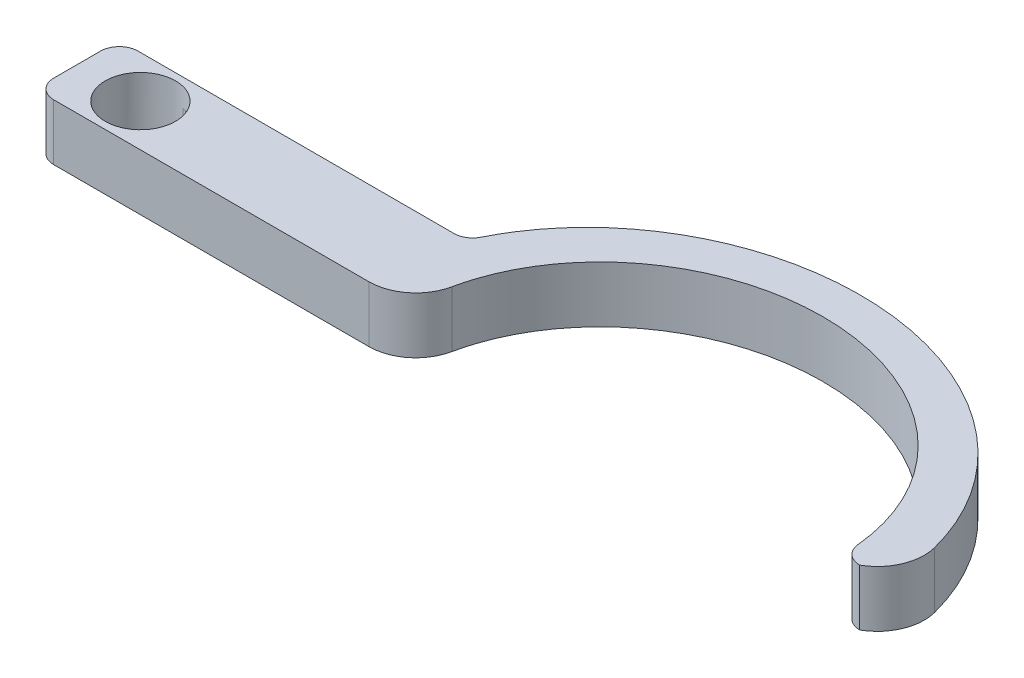
ISO-10303-21;
HEADER;
FILE_DESCRIPTION(('STEP AP214'),'2;1');
FILE_NAME('part.step','',(''),(''),'','','');
FILE_SCHEMA(('AUTOMOTIVE_DESIGN { 1 0 10303 214 1 1 1 1 }'));
ENDSEC;
DATA;
#1=APPLICATION_CONTEXT('core data for automotive mechanical design processes');
#2=APPLICATION_PROTOCOL_DEFINITION('international standard','automotive_design',2000,#1);
#3=PRODUCT_CONTEXT('',#1,'mechanical');
#4=PRODUCT('Part','Part','',(#3));
#5=PRODUCT_RELATED_PRODUCT_CATEGORY('part','',(#4));
#6=PRODUCT_DEFINITION_FORMATION('','',#4);
#7=PRODUCT_DEFINITION_CONTEXT('part definition',#1,'design');
#8=PRODUCT_DEFINITION('design','',#6,#7);
#9=PRODUCT_DEFINITION_SHAPE('','',#8);
#10=(LENGTH_UNIT() NAMED_UNIT(*) SI_UNIT(.MILLI.,.METRE.));
#11=(NAMED_UNIT(*) PLANE_ANGLE_UNIT() SI_UNIT($,.RADIAN.));
#12=(NAMED_UNIT(*) SI_UNIT($,.STERADIAN.) SOLID_ANGLE_UNIT());
#13=UNCERTAINTY_MEASURE_WITH_UNIT(LENGTH_MEASURE(1.E-05),#10,'distance_accuracy_value','');
#14=(GEOMETRIC_REPRESENTATION_CONTEXT(3) GLOBAL_UNCERTAINTY_ASSIGNED_CONTEXT((#13)) GLOBAL_UNIT_ASSIGNED_CONTEXT((#10,
#11,#12)) REPRESENTATION_CONTEXT('',''));
#15=CARTESIAN_POINT('',(0.,0.,0.));
#16=DIRECTION('',(0.,0.,1.));
#17=DIRECTION('',(1.,0.,0.));
#18=AXIS2_PLACEMENT_3D('',#15,#16,#17);
#19=CARTESIAN_POINT('',(17.,-6.,0.));
#20=DIRECTION('',(0.,1.,0.));
#21=DIRECTION('',(0.,0.,1.));
#22=AXIS2_PLACEMENT_3D('',#19,#20,#21);
#23=CYLINDRICAL_SURFACE('',#22,1.6);
#24=CARTESIAN_POINT('',(17.,-2.,0.));
#25=DIRECTION('',(0.,1.,0.));
#26=DIRECTION('',(0.,0.,1.));
#27=AXIS2_PLACEMENT_3D('',#24,#25,#26);
#28=CIRCLE('',#27,1.6);
#29=CARTESIAN_POINT('',(17.1995959499825,-2.,-1.5875016399206));
#30=VERTEX_POINT('',#29);
#31=CARTESIAN_POINT('',(17.1995959499825,-2.,1.5875016399206));
#32=VERTEX_POINT('',#31);
#33=EDGE_CURVE('E353',#30,#32,#28,.F.);
#34=ORIENTED_EDGE('',*,*,#33,.F.);
#35=DIRECTION('',(0.,1.,0.));
#36=VECTOR('',#35,1.);
#37=CARTESIAN_POINT('',(17.1995959499825,-6.,-1.5875016399206));
#38=LINE('',#37,#36);
#39=CARTESIAN_POINT('',(17.1995959499825,-6.,-1.5875016399206));
#40=VERTEX_POINT('',#39);
#41=EDGE_CURVE('E166',#40,#30,#38,.T.);
#42=ORIENTED_EDGE('',*,*,#41,.F.);
#43=CARTESIAN_POINT('',(17.,-6.,0.));
#44=DIRECTION('',(0.,1.,0.));
#45=DIRECTION('',(0.,0.,1.));
#46=AXIS2_PLACEMENT_3D('',#43,#44,#45);
#47=CIRCLE('',#46,1.6);
#48=CARTESIAN_POINT('',(17.1995959499825,-6.,1.5875016399206));
#49=VERTEX_POINT('',#48);
#50=EDGE_CURVE('E148',#49,#40,#47,.T.);
#51=ORIENTED_EDGE('',*,*,#50,.F.);
#52=DIRECTION('',(0.,1.,0.));
#53=VECTOR('',#52,1.);
#54=CARTESIAN_POINT('',(17.1995959499825,-6.,1.5875016399206));
#55=LINE('',#54,#53);
#56=EDGE_CURVE('E156',#49,#32,#55,.T.);
#57=ORIENTED_EDGE('',*,*,#56,.T.);
#58=EDGE_LOOP('',(#34,#42,#51,#57));
#59=FACE_BOUND('',#58,.T.);
#60=ADVANCED_FACE('F36',(#59),#23,.F.);
#61=CARTESIAN_POINT('',(0.464148776248102,-6.,-3.691642758912));
#62=DIRECTION('',(-0.124747468739053,0.,0.992188524950374));
#63=DIRECTION('',(0.992188524950374,0.,0.124747468739053));
#64=AXIS2_PLACEMENT_3D('',#61,#62,#63);
#65=PLANE('',#64);
#66=ORIENTED_EDGE('',*,*,#41,.T.);
#67=DIRECTION('',(-0.992188524950374,0.,-0.124747468739053));
#68=VECTOR('',#67,1.);
#69=CARTESIAN_POINT('',(0.464148776248102,-2.,-3.691642758912));
#70=LINE('',#69,#68);
#71=CARTESIAN_POINT('',(0.928297552496205,-2.,-3.63328551782399));
#72=VERTEX_POINT('',#71);
#73=EDGE_CURVE('E174',#30,#72,#70,.T.);
#74=ORIENTED_EDGE('',*,*,#73,.T.);
#75=DIRECTION('',(0.,1.,0.));
#76=VECTOR('',#75,1.);
#77=CARTESIAN_POINT('',(0.928297552496205,-6.,-3.63328551782399));
#78=LINE('',#77,#76);
#79=CARTESIAN_POINT('',(0.928297552496205,-6.,-3.63328551782399));
#80=VERTEX_POINT('',#79);
#81=EDGE_CURVE('E292',#80,#72,#78,.T.);
#82=ORIENTED_EDGE('',*,*,#81,.F.);
#83=DIRECTION('',(0.992188524950374,0.,0.124747468739053));
#84=VECTOR('',#83,1.);
#85=CARTESIAN_POINT('',(0.464148776248102,-6.,-3.691642758912));
#86=LINE('',#85,#84);
#87=EDGE_CURVE('E178',#80,#40,#86,.T.);
#88=ORIENTED_EDGE('',*,*,#87,.T.);
#89=EDGE_LOOP('',(#66,#74,#82,#88));
#90=FACE_BOUND('',#89,.T.);
#91=ADVANCED_FACE('F201',(#90),#65,.T.);
#92=CARTESIAN_POINT('',(0.464148776248102,-6.,3.691642758912));
#93=DIRECTION('',(0.124747468739053,0.,0.992188524950374));
#94=DIRECTION('',(0.992188524950374,0.,-0.124747468739053));
#95=AXIS2_PLACEMENT_3D('',#92,#93,#94);
#96=PLANE('',#95);
#97=DIRECTION('',(-0.992188524950374,0.,0.124747468739053));
#98=VECTOR('',#97,1.);
#99=CARTESIAN_POINT('',(0.464148776248102,-2.,3.691642758912));
#100=LINE('',#99,#98);
#101=CARTESIAN_POINT('',(0.928297552496205,-2.,3.63328551782399));
#102=VERTEX_POINT('',#101);
#103=EDGE_CURVE('E159',#32,#102,#100,.T.);
#104=ORIENTED_EDGE('',*,*,#103,.F.);
#105=ORIENTED_EDGE('',*,*,#56,.F.);
#106=DIRECTION('',(0.992188524950374,0.,-0.124747468739053));
#107=VECTOR('',#106,1.);
#108=CARTESIAN_POINT('',(0.464148776248102,-6.,3.691642758912));
#109=LINE('',#108,#107);
#110=CARTESIAN_POINT('',(0.928297552496205,-6.,3.63328551782399));
#111=VERTEX_POINT('',#110);
#112=EDGE_CURVE('E143',#111,#49,#109,.T.);
#113=ORIENTED_EDGE('',*,*,#112,.F.);
#114=DIRECTION('',(0.,1.,0.));
#115=VECTOR('',#114,1.);
#116=CARTESIAN_POINT('',(0.928297552496205,-6.,3.63328551782399));
#117=LINE('',#116,#115);
#118=EDGE_CURVE('E162',#111,#102,#117,.T.);
#119=ORIENTED_EDGE('',*,*,#118,.T.);
#120=EDGE_LOOP('',(#104,#105,#113,#119));
#121=FACE_BOUND('',#120,.T.);
#122=ADVANCED_FACE('F157',(#121),#96,.F.);
#123=CARTESIAN_POINT('',(0.,-6.,4.5));
#124=DIRECTION('',(0.,0.,1.));
#125=DIRECTION('',(1.,0.,0.));
#126=AXIS2_PLACEMENT_3D('',#123,#124,#125);
#127=PLANE('',#126);
#128=DIRECTION('',(1.,0.,0.));
#129=VECTOR('',#128,1.);
#130=CARTESIAN_POINT('',(0.,-6.,4.5));
#131=LINE('',#130,#129);
#132=CARTESIAN_POINT('',(-4.75,-6.,4.5));
#133=VERTEX_POINT('',#132);
#134=CARTESIAN_POINT('',(28.894642136041,-6.,4.5));
#135=VERTEX_POINT('',#134);
#136=EDGE_CURVE('E180',#133,#135,#131,.T.);
#137=ORIENTED_EDGE('',*,*,#136,.T.);
#138=DIRECTION('',(0.,-1.,0.));
#139=VECTOR('',#138,1.);
#140=CARTESIAN_POINT('',(28.894642136041,0.,4.5));
#141=LINE('',#140,#139);
#142=CARTESIAN_POINT('',(28.894642136041,0.,4.5));
#143=VERTEX_POINT('',#142);
#144=EDGE_CURVE('E44',#135,#143,#141,.F.);
#145=ORIENTED_EDGE('',*,*,#144,.T.);
#146=DIRECTION('',(1.,0.,0.));
#147=VECTOR('',#146,1.);
#148=CARTESIAN_POINT('',(0.,0.,4.5));
#149=LINE('',#148,#147);
#150=CARTESIAN_POINT('',(-4.75,0.,4.5));
#151=VERTEX_POINT('',#150);
#152=EDGE_CURVE('E302',#151,#143,#149,.T.);
#153=ORIENTED_EDGE('',*,*,#152,.F.);
#154=DIRECTION('',(0.,1.,0.));
#155=VECTOR('',#154,1.);
#156=CARTESIAN_POINT('',(-4.75,-6.,4.5));
#157=LINE('',#156,#155);
#158=EDGE_CURVE('E258',#151,#133,#157,.F.);
#159=ORIENTED_EDGE('',*,*,#158,.T.);
#160=EDGE_LOOP('',(#137,#145,#153,#159));
#161=FACE_BOUND('',#160,.T.);
#162=ADVANCED_FACE('F196',(#161),#127,.T.);
#163=CARTESIAN_POINT('',(-6.75,-6.,0.));
#164=DIRECTION('',(-1.,0.,0.));
#165=DIRECTION('',(0.,0.,1.));
#166=AXIS2_PLACEMENT_3D('',#163,#164,#165);
#167=PLANE('',#166);
#168=DIRECTION('',(0.,0.,1.));
#169=VECTOR('',#168,1.);
#170=CARTESIAN_POINT('',(-6.75,0.,0.));
#171=LINE('',#170,#169);
#172=CARTESIAN_POINT('',(-6.75,0.,-2.5));
#173=VERTEX_POINT('',#172);
#174=CARTESIAN_POINT('',(-6.75,0.,2.5));
#175=VERTEX_POINT('',#174);
#176=EDGE_CURVE('E168',#173,#175,#171,.T.);
#177=ORIENTED_EDGE('',*,*,#176,.F.);
#178=DIRECTION('',(0.,1.,0.));
#179=VECTOR('',#178,1.);
#180=CARTESIAN_POINT('',(-6.75,-6.,-2.5));
#181=LINE('',#180,#179);
#182=CARTESIAN_POINT('',(-6.75,-6.,-2.5));
#183=VERTEX_POINT('',#182);
#184=EDGE_CURVE('E260',#173,#183,#181,.F.);
#185=ORIENTED_EDGE('',*,*,#184,.T.);
#186=DIRECTION('',(0.,0.,1.));
#187=VECTOR('',#186,1.);
#188=CARTESIAN_POINT('',(-6.75,-6.,0.));
#189=LINE('',#188,#187);
#190=CARTESIAN_POINT('',(-6.75,-6.,2.5));
#191=VERTEX_POINT('',#190);
#192=EDGE_CURVE('E163',#183,#191,#189,.T.);
#193=ORIENTED_EDGE('',*,*,#192,.T.);
#194=DIRECTION('',(0.,1.,0.));
#195=VECTOR('',#194,1.);
#196=CARTESIAN_POINT('',(-6.75,-6.,2.5));
#197=LINE('',#196,#195);
#198=EDGE_CURVE('E262',#191,#175,#197,.T.);
#199=ORIENTED_EDGE('',*,*,#198,.T.);
#200=EDGE_LOOP('',(#177,#185,#193,#199));
#201=FACE_BOUND('',#200,.T.);
#202=ADVANCED_FACE('F199',(#201),#167,.T.);
#203=CARTESIAN_POINT('',(0.,-6.,-4.5));
#204=DIRECTION('',(0.,0.,1.));
#205=DIRECTION('',(1.,0.,0.));
#206=AXIS2_PLACEMENT_3D('',#203,#204,#205);
#207=PLANE('',#206);
#208=DIRECTION('',(1.,0.,0.));
#209=VECTOR('',#208,1.);
#210=CARTESIAN_POINT('',(0.,0.,-4.5));
#211=LINE('',#210,#209);
#212=CARTESIAN_POINT('',(-4.75,0.,-4.5));
#213=VERTEX_POINT('',#212);
#214=CARTESIAN_POINT('',(28.973299270242,0.,-4.5));
#215=VERTEX_POINT('',#214);
#216=EDGE_CURVE('E171',#213,#215,#211,.T.);
#217=ORIENTED_EDGE('',*,*,#216,.T.);
#218=DIRECTION('',(0.,1.,0.));
#219=VECTOR('',#218,1.);
#220=CARTESIAN_POINT('',(28.973299270242,-6.,-4.5));
#221=LINE('',#220,#219);
#222=CARTESIAN_POINT('',(28.973299270242,-6.,-4.5));
#223=VERTEX_POINT('',#222);
#224=EDGE_CURVE('E265',#215,#223,#221,.F.);
#225=ORIENTED_EDGE('',*,*,#224,.T.);
#226=DIRECTION('',(1.,0.,0.));
#227=VECTOR('',#226,1.);
#228=CARTESIAN_POINT('',(0.,-6.,-4.5));
#229=LINE('',#228,#227);
#230=CARTESIAN_POINT('',(-4.75,-6.,-4.5));
#231=VERTEX_POINT('',#230);
#232=EDGE_CURVE('E309',#231,#223,#229,.T.);
#233=ORIENTED_EDGE('',*,*,#232,.F.);
#234=DIRECTION('',(0.,1.,0.));
#235=VECTOR('',#234,1.);
#236=CARTESIAN_POINT('',(-4.75,0.,-4.5));
#237=LINE('',#236,#235);
#238=EDGE_CURVE('E267',#231,#213,#237,.T.);
#239=ORIENTED_EDGE('',*,*,#238,.T.);
#240=EDGE_LOOP('',(#217,#225,#233,#239));
#241=FACE_BOUND('',#240,.T.);
#242=ADVANCED_FACE('F323',(#241),#207,.F.);
#243=CARTESIAN_POINT('',(56.3726644889069,-6.,4.5));
#244=DIRECTION('',(0.,1.,0.));
#245=DIRECTION('',(1.,0.,0.));
#246=AXIS2_PLACEMENT_3D('',#243,#244,#245);
#247=ELLIPSE('',#246,28.,25.);
#248=DIRECTION('',(0.,1.,0.));
#249=VECTOR('',#248,1.);
#250=SURFACE_OF_LINEAR_EXTRUSION('',#247,#249);
#251=CARTESIAN_POINT('',(56.3726644889069,0.,4.5));
#252=DIRECTION('',(0.,1.,0.));
#253=DIRECTION('',(1.,0.,0.));
#254=AXIS2_PLACEMENT_3D('',#251,#252,#253);
#255=ELLIPSE('',#254,28.,25.);
#256=CARTESIAN_POINT('',(83.6611586996226,0.,-1.10000709728007));
#257=VERTEX_POINT('',#256);
#258=CARTESIAN_POINT('',(30.765467491492,0.,-5.61223141149198));
#259=VERTEX_POINT('',#258);
#260=EDGE_CURVE('E298',#257,#259,#255,.T.);
#261=ORIENTED_EDGE('',*,*,#260,.F.);
#262=DIRECTION('',(0.,1.,0.));
#263=VECTOR('',#262,1.);
#264=CARTESIAN_POINT('',(83.6611586996226,0.,-1.10000709728006));
#265=LINE('',#264,#263);
#266=CARTESIAN_POINT('',(83.6611586996226,-6.,-1.10000709728005));
#267=VERTEX_POINT('',#266);
#268=EDGE_CURVE('E239',#257,#267,#265,.F.);
#269=ORIENTED_EDGE('',*,*,#268,.T.);
#270=CARTESIAN_POINT('',(30.765467491492,-6.,-5.61223141149198));
#271=VERTEX_POINT('',#270);
#272=EDGE_CURVE('E185',#267,#271,#247,.T.);
#273=ORIENTED_EDGE('',*,*,#272,.T.);
#274=DIRECTION('',(0.,1.,0.));
#275=VECTOR('',#274,1.);
#276=CARTESIAN_POINT('',(30.765467491492,-6.,-5.61223141149198));
#277=LINE('',#276,#275);
#278=EDGE_CURVE('E270',#271,#259,#277,.T.);
#279=ORIENTED_EDGE('',*,*,#278,.T.);
#280=EDGE_LOOP('',(#261,#269,#273,#279));
#281=FACE_BOUND('',#280,.T.);
#282=ADVANCED_FACE('F194',(#281),#250,.T.);
#283=CARTESIAN_POINT('',(0.,-6.,0.));
#284=DIRECTION('',(0.,1.,0.));
#285=DIRECTION('',(0.,0.,1.));
#286=AXIS2_PLACEMENT_3D('',#283,#284,#285);
#287=CYLINDRICAL_SURFACE('',#286,3.75);
#288=CARTESIAN_POINT('',(0.,0.,0.));
#289=DIRECTION('',(0.,1.,0.));
#290=DIRECTION('',(0.,0.,1.));
#291=AXIS2_PLACEMENT_3D('',#288,#289,#290);
#292=CIRCLE('',#291,3.75);
#293=CARTESIAN_POINT('',(0.,0.,3.75));
#294=VERTEX_POINT('',#293);
#295=EDGE_CURVE('E305',#294,#294,#292,.T.);
#296=ORIENTED_EDGE('',*,*,#295,.T.);
#297=EDGE_LOOP('',(#296));
#298=FACE_BOUND('',#297,.T.);
#299=ORIENTED_EDGE('',*,*,#81,.T.);
#300=CARTESIAN_POINT('',(0.,-2.,0.));
#301=DIRECTION('',(0.,1.,0.));
#302=DIRECTION('',(0.,0.,1.));
#303=AXIS2_PLACEMENT_3D('',#300,#301,#302);
#304=CIRCLE('',#303,3.75);
#305=EDGE_CURVE('E355',#102,#72,#304,.T.);
#306=ORIENTED_EDGE('',*,*,#305,.F.);
#307=ORIENTED_EDGE('',*,*,#118,.F.);
#308=CARTESIAN_POINT('',(0.,-6.,0.));
#309=DIRECTION('',(0.,1.,0.));
#310=DIRECTION('',(0.,0.,1.));
#311=AXIS2_PLACEMENT_3D('',#308,#309,#310);
#312=CIRCLE('',#311,3.75);
#313=EDGE_CURVE('E151',#80,#111,#312,.T.);
#314=ORIENTED_EDGE('',*,*,#313,.F.);
#315=EDGE_LOOP('',(#299,#306,#307,#314));
#316=FACE_BOUND('',#315,.T.);
#317=ADVANCED_FACE('F193',(#298,#316),#287,.F.);
#318=CARTESIAN_POINT('',(56.3726644889069,-6.,4.5));
#319=DIRECTION('',(0.,1.,0.));
#320=DIRECTION('',(1.,0.,0.));
#321=AXIS2_PLACEMENT_3D('',#318,#319,#320);
#322=ELLIPSE('',#321,23.,21.);
#323=DIRECTION('',(0.,1.,0.));
#324=VECTOR('',#323,1.);
#325=SURFACE_OF_LINEAR_EXTRUSION('',#322,#324);
#326=CARTESIAN_POINT('',(56.3726644889069,0.,4.5));
#327=DIRECTION('',(0.,1.,0.));
#328=DIRECTION('',(1.,0.,0.));
#329=AXIS2_PLACEMENT_3D('',#326,#327,#328);
#330=ELLIPSE('',#329,23.,21.);
#331=CARTESIAN_POINT('',(79.286958880521,0.,2.68878487158995));
#332=VERTEX_POINT('',#331);
#333=CARTESIAN_POINT('',(33.7871360412384,0.,0.531263006030345));
#334=VERTEX_POINT('',#333);
#335=EDGE_CURVE('E300',#332,#334,#330,.T.);
#336=ORIENTED_EDGE('',*,*,#335,.T.);
#337=DIRECTION('',(0.,1.,0.));
#338=VECTOR('',#337,1.);
#339=CARTESIAN_POINT('',(33.7871360412384,0.,0.531263006030345));
#340=LINE('',#339,#338);
#341=CARTESIAN_POINT('',(33.7871360412384,-6.,0.531263006030345));
#342=VERTEX_POINT('',#341);
#343=EDGE_CURVE('E11',#334,#342,#340,.F.);
#344=ORIENTED_EDGE('',*,*,#343,.T.);
#345=CARTESIAN_POINT('',(79.286958880521,-6.,2.68878487158995));
#346=VERTEX_POINT('',#345);
#347=EDGE_CURVE('E182',#346,#342,#322,.T.);
#348=ORIENTED_EDGE('',*,*,#347,.F.);
#349=DIRECTION('',(0.,1.,0.));
#350=VECTOR('',#349,1.);
#351=CARTESIAN_POINT('',(79.286958880521,-6.,2.68878487158995));
#352=LINE('',#351,#350);
#353=EDGE_CURVE('E287',#346,#332,#352,.T.);
#354=ORIENTED_EDGE('',*,*,#353,.T.);
#355=EDGE_LOOP('',(#336,#344,#348,#354));
#356=FACE_BOUND('',#355,.T.);
#357=ADVANCED_FACE('F189',(#356),#325,.F.);
#358=CARTESIAN_POINT('',(0.,-6.,0.));
#359=DIRECTION('',(0.,1.,0.));
#360=DIRECTION('',(0.,0.,1.));
#361=AXIS2_PLACEMENT_3D('',#358,#359,#360);
#362=PLANE('',#361);
#363=ORIENTED_EDGE('',*,*,#50,.T.);
#364=ORIENTED_EDGE('',*,*,#87,.F.);
#365=ORIENTED_EDGE('',*,*,#313,.T.);
#366=ORIENTED_EDGE('',*,*,#112,.T.);
#367=EDGE_LOOP('',(#363,#364,#365,#366));
#368=FACE_BOUND('',#367,.T.);
#369=ORIENTED_EDGE('',*,*,#272,.F.);
#370=CARTESIAN_POINT('',(78.8190197906105,-6.,0.146464236457973));
#371=DIRECTION('',(0.,1.,0.));
#372=DIRECTION('',(0.,0.,1.));
#373=AXIS2_PLACEMENT_3D('',#370,#371,#372);
#374=CIRCLE('',#373,5.);
#375=CARTESIAN_POINT('',(81.278029012952,-6.,4.5));
#376=VERTEX_POINT('',#375);
#377=EDGE_CURVE('E238',#267,#376,#374,.F.);
#378=ORIENTED_EDGE('',*,*,#377,.T.);
#379=CARTESIAN_POINT('',(81.278029012952,-6.,2.5));
#380=DIRECTION('',(0.,1.,0.));
#381=DIRECTION('',(0.,0.,1.));
#382=AXIS2_PLACEMENT_3D('',#379,#380,#381);
#383=CIRCLE('',#382,2.);
#384=EDGE_CURVE('E273',#376,#346,#383,.F.);
#385=ORIENTED_EDGE('',*,*,#384,.T.);
#386=ORIENTED_EDGE('',*,*,#347,.T.);
#387=CARTESIAN_POINT('',(28.894642136041,-6.,-0.499999999999999));
#388=DIRECTION('',(0.,1.,0.));
#389=DIRECTION('',(0.,0.,1.));
#390=AXIS2_PLACEMENT_3D('',#387,#388,#389);
#391=CIRCLE('',#390,5.);
#392=EDGE_CURVE('E51',#342,#135,#391,.F.);
#393=ORIENTED_EDGE('',*,*,#392,.T.);
#394=ORIENTED_EDGE('',*,*,#136,.F.);
#395=CARTESIAN_POINT('',(-4.75,-6.,2.5));
#396=DIRECTION('',(0.,1.,0.));
#397=DIRECTION('',(0.,0.,1.));
#398=AXIS2_PLACEMENT_3D('',#395,#396,#397);
#399=CIRCLE('',#398,2.);
#400=EDGE_CURVE('E277',#133,#191,#399,.F.);
#401=ORIENTED_EDGE('',*,*,#400,.T.);
#402=ORIENTED_EDGE('',*,*,#192,.F.);
#403=CARTESIAN_POINT('',(-4.75,-6.,-2.5));
#404=DIRECTION('',(0.,1.,0.));
#405=DIRECTION('',(0.,0.,1.));
#406=AXIS2_PLACEMENT_3D('',#403,#404,#405);
#407=CIRCLE('',#406,2.);
#408=EDGE_CURVE('E275',#183,#231,#407,.F.);
#409=ORIENTED_EDGE('',*,*,#408,.T.);
#410=ORIENTED_EDGE('',*,*,#232,.T.);
#411=CARTESIAN_POINT('',(28.973299270242,-6.,-6.5));
#412=DIRECTION('',(0.,1.,0.));
#413=DIRECTION('',(0.,0.,1.));
#414=AXIS2_PLACEMENT_3D('',#411,#412,#413);
#415=CIRCLE('',#414,2.);
#416=EDGE_CURVE('E253',#223,#271,#415,.T.);
#417=ORIENTED_EDGE('',*,*,#416,.T.);
#418=EDGE_LOOP('',(#369,#378,#385,#386,#393,#394,#401,#402,#409,#410,#417));
#419=FACE_BOUND('',#418,.T.);
#420=ADVANCED_FACE('F145',(#368,#419),#362,.F.);
#421=CARTESIAN_POINT('',(0.,0.,0.));
#422=DIRECTION('',(0.,1.,0.));
#423=DIRECTION('',(0.,0.,1.));
#424=AXIS2_PLACEMENT_3D('',#421,#422,#423);
#425=PLANE('',#424);
#426=CARTESIAN_POINT('',(81.278029012952,0.,2.5));
#427=DIRECTION('',(0.,1.,0.));
#428=DIRECTION('',(0.,0.,1.));
#429=AXIS2_PLACEMENT_3D('',#426,#427,#428);
#430=CIRCLE('',#429,2.);
#431=CARTESIAN_POINT('',(81.278029012952,0.,4.5));
#432=VERTEX_POINT('',#431);
#433=EDGE_CURVE('E280',#332,#432,#430,.T.);
#434=ORIENTED_EDGE('',*,*,#433,.T.);
#435=CARTESIAN_POINT('',(78.8190197906105,0.,0.146464236457973));
#436=DIRECTION('',(0.,1.,0.));
#437=DIRECTION('',(0.,0.,1.));
#438=AXIS2_PLACEMENT_3D('',#435,#436,#437);
#439=CIRCLE('',#438,5.);
#440=EDGE_CURVE('E249',#432,#257,#439,.T.);
#441=ORIENTED_EDGE('',*,*,#440,.T.);
#442=ORIENTED_EDGE('',*,*,#260,.T.);
#443=CARTESIAN_POINT('',(28.973299270242,0.,-6.5));
#444=DIRECTION('',(0.,1.,0.));
#445=DIRECTION('',(0.,0.,1.));
#446=AXIS2_PLACEMENT_3D('',#443,#444,#445);
#447=CIRCLE('',#446,2.);
#448=EDGE_CURVE('E256',#259,#215,#447,.F.);
#449=ORIENTED_EDGE('',*,*,#448,.T.);
#450=ORIENTED_EDGE('',*,*,#216,.F.);
#451=CARTESIAN_POINT('',(-4.75,0.,-2.5));
#452=DIRECTION('',(0.,1.,0.));
#453=DIRECTION('',(0.,0.,1.));
#454=AXIS2_PLACEMENT_3D('',#451,#452,#453);
#455=CIRCLE('',#454,2.);
#456=EDGE_CURVE('E283',#213,#173,#455,.T.);
#457=ORIENTED_EDGE('',*,*,#456,.T.);
#458=ORIENTED_EDGE('',*,*,#176,.T.);
#459=CARTESIAN_POINT('',(-4.75,0.,2.5));
#460=DIRECTION('',(0.,1.,0.));
#461=DIRECTION('',(0.,0.,1.));
#462=AXIS2_PLACEMENT_3D('',#459,#460,#461);
#463=CIRCLE('',#462,2.);
#464=EDGE_CURVE('E285',#175,#151,#463,.T.);
#465=ORIENTED_EDGE('',*,*,#464,.T.);
#466=ORIENTED_EDGE('',*,*,#152,.T.);
#467=CARTESIAN_POINT('',(28.894642136041,0.,-0.499999999999999));
#468=DIRECTION('',(0.,1.,0.));
#469=DIRECTION('',(0.,0.,1.));
#470=AXIS2_PLACEMENT_3D('',#467,#468,#469);
#471=CIRCLE('',#470,5.);
#472=EDGE_CURVE('E251',#143,#334,#471,.T.);
#473=ORIENTED_EDGE('',*,*,#472,.T.);
#474=ORIENTED_EDGE('',*,*,#335,.F.);
#475=EDGE_LOOP('',(#434,#441,#442,#449,#450,#457,#458,#465,#466,#473,#474));
#476=FACE_BOUND('',#475,.T.);
#477=ORIENTED_EDGE('',*,*,#295,.F.);
#478=EDGE_LOOP('',(#477));
#479=FACE_BOUND('',#478,.T.);
#480=ADVANCED_FACE('F320',(#476,#479),#425,.T.);
#481=CARTESIAN_POINT('',(0.,-2.,0.));
#482=DIRECTION('',(0.,1.,0.));
#483=DIRECTION('',(0.,0.,1.));
#484=AXIS2_PLACEMENT_3D('',#481,#482,#483);
#485=PLANE('',#484);
#486=ORIENTED_EDGE('',*,*,#73,.F.);
#487=ORIENTED_EDGE('',*,*,#33,.T.);
#488=ORIENTED_EDGE('',*,*,#103,.T.);
#489=ORIENTED_EDGE('',*,*,#305,.T.);
#490=EDGE_LOOP('',(#486,#487,#488,#489));
#491=FACE_BOUND('',#490,.T.);
#492=ADVANCED_FACE('F216',(#491),#485,.F.);
#493=CARTESIAN_POINT('',(81.278029012952,-3.,2.5));
#494=DIRECTION('',(0.,1.,0.));
#495=DIRECTION('',(0.,0.,1.));
#496=AXIS2_PLACEMENT_3D('',#493,#494,#495);
#497=CYLINDRICAL_SURFACE('',#496,2.);
#498=ORIENTED_EDGE('',*,*,#384,.F.);
#499=DIRECTION('',(0.,-1.,0.));
#500=VECTOR('',#499,1.);
#501=CARTESIAN_POINT('',(81.278029012952,-6.,4.5));
#502=LINE('',#501,#500);
#503=EDGE_CURVE('E241',#432,#376,#502,.T.);
#504=ORIENTED_EDGE('',*,*,#503,.F.);
#505=ORIENTED_EDGE('',*,*,#433,.F.);
#506=ORIENTED_EDGE('',*,*,#353,.F.);
#507=EDGE_LOOP('',(#498,#504,#505,#506));
#508=FACE_BOUND('',#507,.T.);
#509=ADVANCED_FACE('F212',(#508),#497,.T.);
#510=CARTESIAN_POINT('',(28.973299270242,-3.,-6.5));
#511=DIRECTION('',(0.,1.,0.));
#512=DIRECTION('',(0.,0.,1.));
#513=AXIS2_PLACEMENT_3D('',#510,#511,#512);
#514=CYLINDRICAL_SURFACE('',#513,2.);
#515=ORIENTED_EDGE('',*,*,#416,.F.);
#516=ORIENTED_EDGE('',*,*,#224,.F.);
#517=ORIENTED_EDGE('',*,*,#448,.F.);
#518=ORIENTED_EDGE('',*,*,#278,.F.);
#519=EDGE_LOOP('',(#515,#516,#517,#518));
#520=FACE_BOUND('',#519,.T.);
#521=ADVANCED_FACE('F215',(#520),#514,.F.);
#522=CARTESIAN_POINT('',(-4.75,-6.,-2.5));
#523=DIRECTION('',(0.,-1.,0.));
#524=DIRECTION('',(0.,0.,-1.));
#525=AXIS2_PLACEMENT_3D('',#522,#523,#524);
#526=CYLINDRICAL_SURFACE('',#525,2.);
#527=ORIENTED_EDGE('',*,*,#408,.F.);
#528=ORIENTED_EDGE('',*,*,#184,.F.);
#529=ORIENTED_EDGE('',*,*,#456,.F.);
#530=ORIENTED_EDGE('',*,*,#238,.F.);
#531=EDGE_LOOP('',(#527,#528,#529,#530));
#532=FACE_BOUND('',#531,.T.);
#533=ADVANCED_FACE('F220',(#532),#526,.T.);
#534=CARTESIAN_POINT('',(-4.75,-6.,2.5));
#535=DIRECTION('',(0.,1.,0.));
#536=DIRECTION('',(0.,0.,1.));
#537=AXIS2_PLACEMENT_3D('',#534,#535,#536);
#538=CYLINDRICAL_SURFACE('',#537,2.);
#539=ORIENTED_EDGE('',*,*,#400,.F.);
#540=ORIENTED_EDGE('',*,*,#158,.F.);
#541=ORIENTED_EDGE('',*,*,#464,.F.);
#542=ORIENTED_EDGE('',*,*,#198,.F.);
#543=EDGE_LOOP('',(#539,#540,#541,#542));
#544=FACE_BOUND('',#543,.T.);
#545=ADVANCED_FACE('F224',(#544),#538,.T.);
#546=CARTESIAN_POINT('',(78.8190197906105,-3.,0.146464236457973));
#547=DIRECTION('',(0.,1.,0.));
#548=DIRECTION('',(0.,0.,1.));
#549=AXIS2_PLACEMENT_3D('',#546,#547,#548);
#550=CYLINDRICAL_SURFACE('',#549,5.);
#551=ORIENTED_EDGE('',*,*,#377,.F.);
#552=ORIENTED_EDGE('',*,*,#268,.F.);
#553=ORIENTED_EDGE('',*,*,#440,.F.);
#554=ORIENTED_EDGE('',*,*,#503,.T.);
#555=EDGE_LOOP('',(#551,#552,#553,#554));
#556=FACE_BOUND('',#555,.T.);
#557=ADVANCED_FACE('F227',(#556),#550,.T.);
#558=CARTESIAN_POINT('',(28.894642136041,-3.,-0.499999999999999));
#559=DIRECTION('',(0.,1.,0.));
#560=DIRECTION('',(0.,0.,1.));
#561=AXIS2_PLACEMENT_3D('',#558,#559,#560);
#562=CYLINDRICAL_SURFACE('',#561,5.);
#563=ORIENTED_EDGE('',*,*,#392,.F.);
#564=ORIENTED_EDGE('',*,*,#343,.F.);
#565=ORIENTED_EDGE('',*,*,#472,.F.);
#566=ORIENTED_EDGE('',*,*,#144,.F.);
#567=EDGE_LOOP('',(#563,#564,#565,#566));
#568=FACE_BOUND('',#567,.T.);
#569=ADVANCED_FACE('F38',(#568),#562,.T.);
#570=CLOSED_SHELL('',(#60,#91,#122,#162,#202,#242,#282,#317,#357,#420,#480,#492,#509,#521,#533,
#545,#557,#569));
#571=MANIFOLD_SOLID_BREP('B2',#570);
#572=ADVANCED_BREP_SHAPE_REPRESENTATION('',(#18,#571),#14);
#573=SHAPE_DEFINITION_REPRESENTATION(#9,#572);
ENDSEC;
END-ISO-10303-21;
